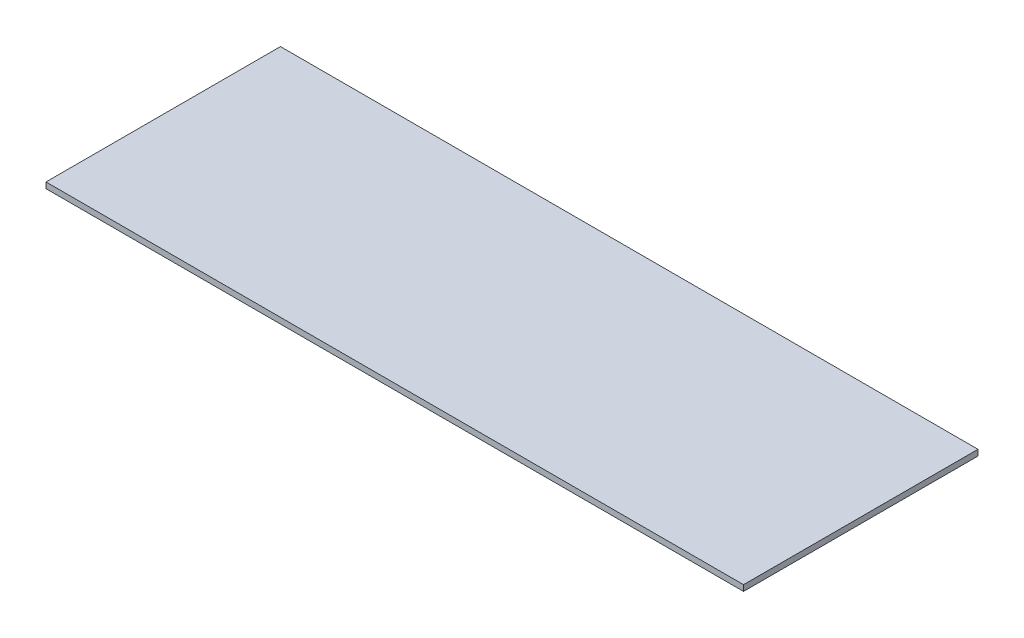
ISO-10303-21;
HEADER;
FILE_DESCRIPTION(('STEP AP214'),'2;1');
FILE_NAME('part.step','',(''),(''),'','','');
FILE_SCHEMA(('AUTOMOTIVE_DESIGN { 1 0 10303 214 1 1 1 1 }'));
ENDSEC;
DATA;
#1=APPLICATION_CONTEXT('core data for automotive mechanical design processes');
#2=APPLICATION_PROTOCOL_DEFINITION('international standard','automotive_design',2000,#1);
#3=PRODUCT_CONTEXT('',#1,'mechanical');
#4=PRODUCT('Part','Part','',(#3));
#5=PRODUCT_RELATED_PRODUCT_CATEGORY('part','',(#4));
#6=PRODUCT_DEFINITION_FORMATION('','',#4);
#7=PRODUCT_DEFINITION_CONTEXT('part definition',#1,'design');
#8=PRODUCT_DEFINITION('design','',#6,#7);
#9=PRODUCT_DEFINITION_SHAPE('','',#8);
#10=(LENGTH_UNIT() NAMED_UNIT(*) SI_UNIT(.MILLI.,.METRE.));
#11=(NAMED_UNIT(*) PLANE_ANGLE_UNIT() SI_UNIT($,.RADIAN.));
#12=(NAMED_UNIT(*) SI_UNIT($,.STERADIAN.) SOLID_ANGLE_UNIT());
#13=UNCERTAINTY_MEASURE_WITH_UNIT(LENGTH_MEASURE(1.E-05),#10,'distance_accuracy_value','');
#14=(GEOMETRIC_REPRESENTATION_CONTEXT(3) GLOBAL_UNCERTAINTY_ASSIGNED_CONTEXT((#13)) GLOBAL_UNIT_ASSIGNED_CONTEXT((#10,
#11,#12)) REPRESENTATION_CONTEXT('',''));
#15=CARTESIAN_POINT('',(0.,0.,0.));
#16=DIRECTION('',(0.,0.,1.));
#17=DIRECTION('',(1.,0.,0.));
#18=AXIS2_PLACEMENT_3D('',#15,#16,#17);
#19=CARTESIAN_POINT('',(755.65,12.7,254.));
#20=DIRECTION('',(-1.,0.,0.));
#21=DIRECTION('',(0.,0.,1.));
#22=AXIS2_PLACEMENT_3D('',#19,#20,#21);
#23=PLANE('',#22);
#24=DIRECTION('',(0.,0.,-1.));
#25=VECTOR('',#24,1.);
#26=CARTESIAN_POINT('',(755.65,0.,254.));
#27=LINE('',#26,#25);
#28=CARTESIAN_POINT('',(755.65,0.,254.));
#29=VERTEX_POINT('',#28);
#30=CARTESIAN_POINT('',(755.65,0.,-254.));
#31=VERTEX_POINT('',#30);
#32=EDGE_CURVE('E117',#29,#31,#27,.T.);
#33=ORIENTED_EDGE('',*,*,#32,.T.);
#34=DIRECTION('',(0.,-1.,0.));
#35=VECTOR('',#34,1.);
#36=CARTESIAN_POINT('',(755.65,12.7,-254.));
#37=LINE('',#36,#35);
#38=CARTESIAN_POINT('',(755.65,12.7,-254.));
#39=VERTEX_POINT('',#38);
#40=EDGE_CURVE('E11',#39,#31,#37,.T.);
#41=ORIENTED_EDGE('',*,*,#40,.F.);
#42=DIRECTION('',(0.,0.,-1.));
#43=VECTOR('',#42,1.);
#44=CARTESIAN_POINT('',(755.65,12.7,254.));
#45=LINE('',#44,#43);
#46=CARTESIAN_POINT('',(755.65,12.7,254.));
#47=VERTEX_POINT('',#46);
#48=EDGE_CURVE('E101',#47,#39,#45,.T.);
#49=ORIENTED_EDGE('',*,*,#48,.F.);
#50=DIRECTION('',(0.,-1.,0.));
#51=VECTOR('',#50,1.);
#52=CARTESIAN_POINT('',(755.65,12.7,254.));
#53=LINE('',#52,#51);
#54=EDGE_CURVE('E113',#47,#29,#53,.T.);
#55=ORIENTED_EDGE('',*,*,#54,.T.);
#56=EDGE_LOOP('',(#33,#41,#49,#55));
#57=FACE_BOUND('',#56,.T.);
#58=ADVANCED_FACE('F49',(#57),#23,.F.);
#59=CARTESIAN_POINT('',(-755.65,12.7,-254.));
#60=DIRECTION('',(0.,0.,1.));
#61=DIRECTION('',(1.,0.,0.));
#62=AXIS2_PLACEMENT_3D('',#59,#60,#61);
#63=PLANE('',#62);
#64=DIRECTION('',(-1.,0.,0.));
#65=VECTOR('',#64,1.);
#66=CARTESIAN_POINT('',(-755.65,0.,-254.));
#67=LINE('',#66,#65);
#68=CARTESIAN_POINT('',(-755.65,0.,-254.));
#69=VERTEX_POINT('',#68);
#70=EDGE_CURVE('E106',#31,#69,#67,.T.);
#71=ORIENTED_EDGE('',*,*,#70,.T.);
#72=DIRECTION('',(0.,-1.,0.));
#73=VECTOR('',#72,1.);
#74=CARTESIAN_POINT('',(-755.65,12.7,-254.));
#75=LINE('',#74,#73);
#76=CARTESIAN_POINT('',(-755.65,12.7,-254.));
#77=VERTEX_POINT('',#76);
#78=EDGE_CURVE('E58',#77,#69,#75,.T.);
#79=ORIENTED_EDGE('',*,*,#78,.F.);
#80=DIRECTION('',(-1.,0.,0.));
#81=VECTOR('',#80,1.);
#82=CARTESIAN_POINT('',(-755.65,12.7,-254.));
#83=LINE('',#82,#81);
#84=EDGE_CURVE('E96',#39,#77,#83,.T.);
#85=ORIENTED_EDGE('',*,*,#84,.F.);
#86=ORIENTED_EDGE('',*,*,#40,.T.);
#87=EDGE_LOOP('',(#71,#79,#85,#86));
#88=FACE_BOUND('',#87,.T.);
#89=ADVANCED_FACE('F105',(#88),#63,.F.);
#90=CARTESIAN_POINT('',(-755.65,12.7,254.));
#91=DIRECTION('',(1.,0.,0.));
#92=DIRECTION('',(0.,0.,-1.));
#93=AXIS2_PLACEMENT_3D('',#90,#91,#92);
#94=PLANE('',#93);
#95=DIRECTION('',(0.,0.,1.));
#96=VECTOR('',#95,1.);
#97=CARTESIAN_POINT('',(-755.65,0.,254.));
#98=LINE('',#97,#96);
#99=CARTESIAN_POINT('',(-755.65,0.,254.));
#100=VERTEX_POINT('',#99);
#101=EDGE_CURVE('E83',#69,#100,#98,.T.);
#102=ORIENTED_EDGE('',*,*,#101,.T.);
#103=DIRECTION('',(0.,-1.,0.));
#104=VECTOR('',#103,1.);
#105=CARTESIAN_POINT('',(-755.65,12.7,254.));
#106=LINE('',#105,#104);
#107=CARTESIAN_POINT('',(-755.65,12.7,254.));
#108=VERTEX_POINT('',#107);
#109=EDGE_CURVE('E108',#108,#100,#106,.T.);
#110=ORIENTED_EDGE('',*,*,#109,.F.);
#111=DIRECTION('',(0.,0.,1.));
#112=VECTOR('',#111,1.);
#113=CARTESIAN_POINT('',(-755.65,12.7,254.));
#114=LINE('',#113,#112);
#115=EDGE_CURVE('E99',#77,#108,#114,.T.);
#116=ORIENTED_EDGE('',*,*,#115,.F.);
#117=ORIENTED_EDGE('',*,*,#78,.T.);
#118=EDGE_LOOP('',(#102,#110,#116,#117));
#119=FACE_BOUND('',#118,.T.);
#120=ADVANCED_FACE('F109',(#119),#94,.F.);
#121=CARTESIAN_POINT('',(-755.65,12.7,254.));
#122=DIRECTION('',(0.,0.,-1.));
#123=DIRECTION('',(-1.,0.,0.));
#124=AXIS2_PLACEMENT_3D('',#121,#122,#123);
#125=PLANE('',#124);
#126=DIRECTION('',(1.,0.,0.));
#127=VECTOR('',#126,1.);
#128=CARTESIAN_POINT('',(-755.65,0.,254.));
#129=LINE('',#128,#127);
#130=EDGE_CURVE('E89',#100,#29,#129,.T.);
#131=ORIENTED_EDGE('',*,*,#130,.T.);
#132=ORIENTED_EDGE('',*,*,#54,.F.);
#133=DIRECTION('',(1.,0.,0.));
#134=VECTOR('',#133,1.);
#135=CARTESIAN_POINT('',(-755.65,12.7,254.));
#136=LINE('',#135,#134);
#137=EDGE_CURVE('E66',#108,#47,#136,.T.);
#138=ORIENTED_EDGE('',*,*,#137,.F.);
#139=ORIENTED_EDGE('',*,*,#109,.T.);
#140=EDGE_LOOP('',(#131,#132,#138,#139));
#141=FACE_BOUND('',#140,.T.);
#142=ADVANCED_FACE('F130',(#141),#125,.F.);
#143=CARTESIAN_POINT('',(0.,12.7,0.));
#144=DIRECTION('',(0.,-1.,0.));
#145=DIRECTION('',(0.,0.,-1.));
#146=AXIS2_PLACEMENT_3D('',#143,#144,#145);
#147=PLANE('',#146);
#148=ORIENTED_EDGE('',*,*,#48,.T.);
#149=ORIENTED_EDGE('',*,*,#84,.T.);
#150=ORIENTED_EDGE('',*,*,#115,.T.);
#151=ORIENTED_EDGE('',*,*,#137,.T.);
#152=EDGE_LOOP('',(#148,#149,#150,#151));
#153=FACE_BOUND('',#152,.T.);
#154=ADVANCED_FACE('F97',(#153),#147,.F.);
#155=CARTESIAN_POINT('',(0.,0.,0.));
#156=DIRECTION('',(0.,-1.,0.));
#157=DIRECTION('',(0.,0.,-1.));
#158=AXIS2_PLACEMENT_3D('',#155,#156,#157);
#159=PLANE('',#158);
#160=ORIENTED_EDGE('',*,*,#32,.F.);
#161=ORIENTED_EDGE('',*,*,#130,.F.);
#162=ORIENTED_EDGE('',*,*,#101,.F.);
#163=ORIENTED_EDGE('',*,*,#70,.F.);
#164=EDGE_LOOP('',(#160,#161,#162,#163));
#165=FACE_BOUND('',#164,.T.);
#166=ADVANCED_FACE('F133',(#165),#159,.T.);
#167=CLOSED_SHELL('',(#58,#89,#120,#142,#154,#166));
#168=MANIFOLD_SOLID_BREP('B2',#167);
#169=ADVANCED_BREP_SHAPE_REPRESENTATION('',(#18,#168),#14);
#170=SHAPE_DEFINITION_REPRESENTATION(#9,#169);
ENDSEC;
END-ISO-10303-21;
